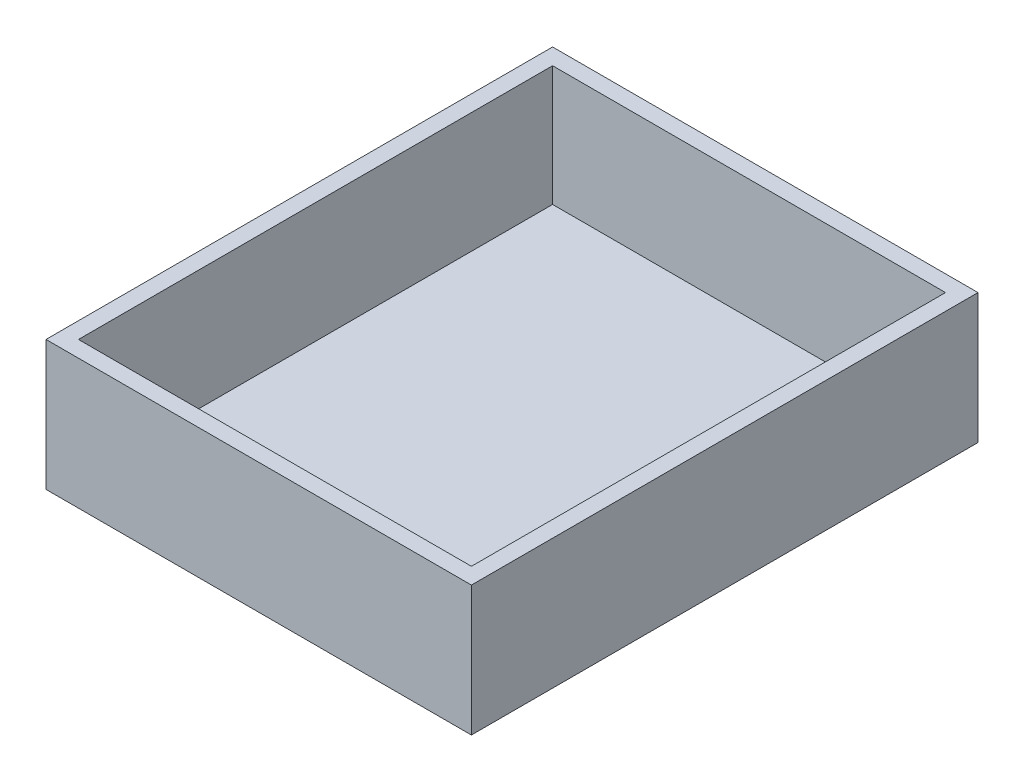
ISO-10303-21;
HEADER;
FILE_DESCRIPTION(('STEP AP214'),'2;1');
FILE_NAME('part.step','',(''),(''),'','','');
FILE_SCHEMA(('AUTOMOTIVE_DESIGN { 1 0 10303 214 1 1 1 1 }'));
ENDSEC;
DATA;
#1=APPLICATION_CONTEXT('core data for automotive mechanical design processes');
#2=APPLICATION_PROTOCOL_DEFINITION('international standard','automotive_design',2000,#1);
#3=PRODUCT_CONTEXT('',#1,'mechanical');
#4=PRODUCT('Part','Part','',(#3));
#5=PRODUCT_RELATED_PRODUCT_CATEGORY('part','',(#4));
#6=PRODUCT_DEFINITION_FORMATION('','',#4);
#7=PRODUCT_DEFINITION_CONTEXT('part definition',#1,'design');
#8=PRODUCT_DEFINITION('design','',#6,#7);
#9=PRODUCT_DEFINITION_SHAPE('','',#8);
#10=(LENGTH_UNIT() NAMED_UNIT(*) SI_UNIT(.MILLI.,.METRE.));
#11=(NAMED_UNIT(*) PLANE_ANGLE_UNIT() SI_UNIT($,.RADIAN.));
#12=(NAMED_UNIT(*) SI_UNIT($,.STERADIAN.) SOLID_ANGLE_UNIT());
#13=UNCERTAINTY_MEASURE_WITH_UNIT(LENGTH_MEASURE(1.E-05),#10,'distance_accuracy_value','');
#14=(GEOMETRIC_REPRESENTATION_CONTEXT(3) GLOBAL_UNCERTAINTY_ASSIGNED_CONTEXT((#13)) GLOBAL_UNIT_ASSIGNED_CONTEXT((#10,
#11,#12)) REPRESENTATION_CONTEXT('',''));
#15=CARTESIAN_POINT('',(0.,0.,0.));
#16=DIRECTION('',(0.,0.,1.));
#17=DIRECTION('',(1.,0.,0.));
#18=AXIS2_PLACEMENT_3D('',#15,#16,#17);
#19=CARTESIAN_POINT('',(65.5,40.,78.));
#20=DIRECTION('',(-1.,0.,0.));
#21=DIRECTION('',(0.,0.,1.));
#22=AXIS2_PLACEMENT_3D('',#19,#20,#21);
#23=PLANE('',#22);
#24=DIRECTION('',(0.,0.,-1.));
#25=VECTOR('',#24,1.);
#26=CARTESIAN_POINT('',(65.5,0.,78.));
#27=LINE('',#26,#25);
#28=CARTESIAN_POINT('',(65.5,0.,78.));
#29=VERTEX_POINT('',#28);
#30=CARTESIAN_POINT('',(65.5,0.,-78.));
#31=VERTEX_POINT('',#30);
#32=EDGE_CURVE('E142',#29,#31,#27,.T.);
#33=ORIENTED_EDGE('',*,*,#32,.T.);
#34=DIRECTION('',(0.,-1.,0.));
#35=VECTOR('',#34,1.);
#36=CARTESIAN_POINT('',(65.5,40.,-78.));
#37=LINE('',#36,#35);
#38=CARTESIAN_POINT('',(65.5,40.,-78.));
#39=VERTEX_POINT('',#38);
#40=EDGE_CURVE('E11',#39,#31,#37,.T.);
#41=ORIENTED_EDGE('',*,*,#40,.F.);
#42=DIRECTION('',(0.,0.,-1.));
#43=VECTOR('',#42,1.);
#44=CARTESIAN_POINT('',(65.5,40.,78.));
#45=LINE('',#44,#43);
#46=CARTESIAN_POINT('',(65.5,40.,78.));
#47=VERTEX_POINT('',#46);
#48=EDGE_CURVE('E146',#47,#39,#45,.T.);
#49=ORIENTED_EDGE('',*,*,#48,.F.);
#50=DIRECTION('',(0.,-1.,0.));
#51=VECTOR('',#50,1.);
#52=CARTESIAN_POINT('',(65.5,40.,78.));
#53=LINE('',#52,#51);
#54=EDGE_CURVE('E152',#47,#29,#53,.T.);
#55=ORIENTED_EDGE('',*,*,#54,.T.);
#56=EDGE_LOOP('',(#33,#41,#49,#55));
#57=FACE_BOUND('',#56,.T.);
#58=ADVANCED_FACE('F34',(#57),#23,.F.);
#59=CARTESIAN_POINT('',(65.5,40.,-78.));
#60=DIRECTION('',(0.,0.,1.));
#61=DIRECTION('',(1.,0.,0.));
#62=AXIS2_PLACEMENT_3D('',#59,#60,#61);
#63=PLANE('',#62);
#64=DIRECTION('',(-1.,0.,0.));
#65=VECTOR('',#64,1.);
#66=CARTESIAN_POINT('',(65.5,0.,-78.));
#67=LINE('',#66,#65);
#68=CARTESIAN_POINT('',(-65.5,0.,-78.));
#69=VERTEX_POINT('',#68);
#70=EDGE_CURVE('E155',#31,#69,#67,.T.);
#71=ORIENTED_EDGE('',*,*,#70,.T.);
#72=DIRECTION('',(0.,-1.,0.));
#73=VECTOR('',#72,1.);
#74=CARTESIAN_POINT('',(-65.5,40.,-78.));
#75=LINE('',#74,#73);
#76=CARTESIAN_POINT('',(-65.5,40.,-78.));
#77=VERTEX_POINT('',#76);
#78=EDGE_CURVE('E41',#77,#69,#75,.T.);
#79=ORIENTED_EDGE('',*,*,#78,.F.);
#80=DIRECTION('',(-1.,0.,0.));
#81=VECTOR('',#80,1.);
#82=CARTESIAN_POINT('',(65.5,40.,-78.));
#83=LINE('',#82,#81);
#84=EDGE_CURVE('E85',#39,#77,#83,.T.);
#85=ORIENTED_EDGE('',*,*,#84,.F.);
#86=ORIENTED_EDGE('',*,*,#40,.T.);
#87=EDGE_LOOP('',(#71,#79,#85,#86));
#88=FACE_BOUND('',#87,.T.);
#89=ADVANCED_FACE('F184',(#88),#63,.F.);
#90=CARTESIAN_POINT('',(-65.5,40.,-78.));
#91=DIRECTION('',(1.,0.,0.));
#92=DIRECTION('',(0.,0.,-1.));
#93=AXIS2_PLACEMENT_3D('',#90,#91,#92);
#94=PLANE('',#93);
#95=DIRECTION('',(0.,0.,1.));
#96=VECTOR('',#95,1.);
#97=CARTESIAN_POINT('',(-65.5,0.,-78.));
#98=LINE('',#97,#96);
#99=CARTESIAN_POINT('',(-65.5,0.,78.));
#100=VERTEX_POINT('',#99);
#101=EDGE_CURVE('E157',#69,#100,#98,.T.);
#102=ORIENTED_EDGE('',*,*,#101,.T.);
#103=DIRECTION('',(0.,-1.,0.));
#104=VECTOR('',#103,1.);
#105=CARTESIAN_POINT('',(-65.5,40.,78.));
#106=LINE('',#105,#104);
#107=CARTESIAN_POINT('',(-65.5,40.,78.));
#108=VERTEX_POINT('',#107);
#109=EDGE_CURVE('E161',#108,#100,#106,.T.);
#110=ORIENTED_EDGE('',*,*,#109,.F.);
#111=DIRECTION('',(0.,0.,1.));
#112=VECTOR('',#111,1.);
#113=CARTESIAN_POINT('',(-65.5,40.,-78.));
#114=LINE('',#113,#112);
#115=EDGE_CURVE('E149',#77,#108,#114,.T.);
#116=ORIENTED_EDGE('',*,*,#115,.F.);
#117=ORIENTED_EDGE('',*,*,#78,.T.);
#118=EDGE_LOOP('',(#102,#110,#116,#117));
#119=FACE_BOUND('',#118,.T.);
#120=ADVANCED_FACE('F166',(#119),#94,.F.);
#121=CARTESIAN_POINT('',(-65.5,40.,78.));
#122=DIRECTION('',(0.,0.,-1.));
#123=DIRECTION('',(-1.,0.,0.));
#124=AXIS2_PLACEMENT_3D('',#121,#122,#123);
#125=PLANE('',#124);
#126=DIRECTION('',(1.,0.,0.));
#127=VECTOR('',#126,1.);
#128=CARTESIAN_POINT('',(-65.5,0.,78.));
#129=LINE('',#128,#127);
#130=EDGE_CURVE('E78',#100,#29,#129,.T.);
#131=ORIENTED_EDGE('',*,*,#130,.T.);
#132=ORIENTED_EDGE('',*,*,#54,.F.);
#133=DIRECTION('',(1.,0.,0.));
#134=VECTOR('',#133,1.);
#135=CARTESIAN_POINT('',(-65.5,40.,78.));
#136=LINE('',#135,#134);
#137=EDGE_CURVE('E57',#108,#47,#136,.T.);
#138=ORIENTED_EDGE('',*,*,#137,.F.);
#139=ORIENTED_EDGE('',*,*,#109,.T.);
#140=EDGE_LOOP('',(#131,#132,#138,#139));
#141=FACE_BOUND('',#140,.T.);
#142=ADVANCED_FACE('F174',(#141),#125,.F.);
#143=CARTESIAN_POINT('',(0.,40.,0.));
#144=DIRECTION('',(0.,1.,0.));
#145=DIRECTION('',(0.,0.,1.));
#146=AXIS2_PLACEMENT_3D('',#143,#144,#145);
#147=PLANE('',#146);
#148=DIRECTION('',(1.,0.,0.));
#149=VECTOR('',#148,1.);
#150=CARTESIAN_POINT('',(-60.5,40.,73.));
#151=LINE('',#150,#149);
#152=CARTESIAN_POINT('',(-60.5,40.,73.));
#153=VERTEX_POINT('',#152);
#154=CARTESIAN_POINT('',(60.5,40.,73.));
#155=VERTEX_POINT('',#154);
#156=EDGE_CURVE('E48',#153,#155,#151,.T.);
#157=ORIENTED_EDGE('',*,*,#156,.F.);
#158=DIRECTION('',(0.,0.,1.));
#159=VECTOR('',#158,1.);
#160=CARTESIAN_POINT('',(-60.5,40.,-73.));
#161=LINE('',#160,#159);
#162=CARTESIAN_POINT('',(-60.5,40.,-73.));
#163=VERTEX_POINT('',#162);
#164=EDGE_CURVE('E127',#163,#153,#161,.T.);
#165=ORIENTED_EDGE('',*,*,#164,.F.);
#166=DIRECTION('',(-1.,0.,0.));
#167=VECTOR('',#166,1.);
#168=CARTESIAN_POINT('',(60.5,40.,-73.));
#169=LINE('',#168,#167);
#170=CARTESIAN_POINT('',(60.5,40.,-73.));
#171=VERTEX_POINT('',#170);
#172=EDGE_CURVE('E130',#171,#163,#169,.T.);
#173=ORIENTED_EDGE('',*,*,#172,.F.);
#174=DIRECTION('',(0.,0.,-1.));
#175=VECTOR('',#174,1.);
#176=CARTESIAN_POINT('',(60.5,40.,73.));
#177=LINE('',#176,#175);
#178=EDGE_CURVE('E136',#155,#171,#177,.T.);
#179=ORIENTED_EDGE('',*,*,#178,.F.);
#180=EDGE_LOOP('',(#157,#165,#173,#179));
#181=FACE_BOUND('',#180,.T.);
#182=ORIENTED_EDGE('',*,*,#48,.T.);
#183=ORIENTED_EDGE('',*,*,#84,.T.);
#184=ORIENTED_EDGE('',*,*,#115,.T.);
#185=ORIENTED_EDGE('',*,*,#137,.T.);
#186=EDGE_LOOP('',(#182,#183,#184,#185));
#187=FACE_BOUND('',#186,.T.);
#188=ADVANCED_FACE('F176',(#181,#187),#147,.T.);
#189=CARTESIAN_POINT('',(0.,0.,0.));
#190=DIRECTION('',(0.,1.,0.));
#191=DIRECTION('',(0.,0.,1.));
#192=AXIS2_PLACEMENT_3D('',#189,#190,#191);
#193=PLANE('',#192);
#194=ORIENTED_EDGE('',*,*,#32,.F.);
#195=ORIENTED_EDGE('',*,*,#130,.F.);
#196=ORIENTED_EDGE('',*,*,#101,.F.);
#197=ORIENTED_EDGE('',*,*,#70,.F.);
#198=EDGE_LOOP('',(#194,#195,#196,#197));
#199=FACE_BOUND('',#198,.T.);
#200=ADVANCED_FACE('F170',(#199),#193,.F.);
#201=CARTESIAN_POINT('',(-60.5,3.,73.));
#202=DIRECTION('',(0.,0.,1.));
#203=DIRECTION('',(1.,0.,0.));
#204=AXIS2_PLACEMENT_3D('',#201,#202,#203);
#205=PLANE('',#204);
#206=ORIENTED_EDGE('',*,*,#156,.T.);
#207=DIRECTION('',(0.,1.,0.));
#208=VECTOR('',#207,1.);
#209=CARTESIAN_POINT('',(60.5,3.,73.));
#210=LINE('',#209,#208);
#211=CARTESIAN_POINT('',(60.5,3.,73.));
#212=VERTEX_POINT('',#211);
#213=EDGE_CURVE('E105',#212,#155,#210,.T.);
#214=ORIENTED_EDGE('',*,*,#213,.F.);
#215=DIRECTION('',(1.,0.,0.));
#216=VECTOR('',#215,1.);
#217=CARTESIAN_POINT('',(-60.5,3.,73.));
#218=LINE('',#217,#216);
#219=CARTESIAN_POINT('',(-60.5,3.,73.));
#220=VERTEX_POINT('',#219);
#221=EDGE_CURVE('E109',#220,#212,#218,.T.);
#222=ORIENTED_EDGE('',*,*,#221,.F.);
#223=DIRECTION('',(0.,1.,0.));
#224=VECTOR('',#223,1.);
#225=CARTESIAN_POINT('',(-60.5,3.,73.));
#226=LINE('',#225,#224);
#227=EDGE_CURVE('E140',#220,#153,#226,.T.);
#228=ORIENTED_EDGE('',*,*,#227,.T.);
#229=EDGE_LOOP('',(#206,#214,#222,#228));
#230=FACE_BOUND('',#229,.T.);
#231=ADVANCED_FACE('F107',(#230),#205,.F.);
#232=CARTESIAN_POINT('',(-60.5,3.,-73.));
#233=DIRECTION('',(-1.,0.,0.));
#234=DIRECTION('',(0.,0.,1.));
#235=AXIS2_PLACEMENT_3D('',#232,#233,#234);
#236=PLANE('',#235);
#237=ORIENTED_EDGE('',*,*,#164,.T.);
#238=ORIENTED_EDGE('',*,*,#227,.F.);
#239=DIRECTION('',(0.,0.,1.));
#240=VECTOR('',#239,1.);
#241=CARTESIAN_POINT('',(-60.5,3.,-73.));
#242=LINE('',#241,#240);
#243=CARTESIAN_POINT('',(-60.5,3.,-73.));
#244=VERTEX_POINT('',#243);
#245=EDGE_CURVE('E115',#244,#220,#242,.T.);
#246=ORIENTED_EDGE('',*,*,#245,.F.);
#247=DIRECTION('',(0.,1.,0.));
#248=VECTOR('',#247,1.);
#249=CARTESIAN_POINT('',(-60.5,3.,-73.));
#250=LINE('',#249,#248);
#251=EDGE_CURVE('E143',#244,#163,#250,.T.);
#252=ORIENTED_EDGE('',*,*,#251,.T.);
#253=EDGE_LOOP('',(#237,#238,#246,#252));
#254=FACE_BOUND('',#253,.T.);
#255=ADVANCED_FACE('F223',(#254),#236,.F.);
#256=CARTESIAN_POINT('',(60.5,3.,-73.));
#257=DIRECTION('',(0.,0.,-1.));
#258=DIRECTION('',(-1.,0.,0.));
#259=AXIS2_PLACEMENT_3D('',#256,#257,#258);
#260=PLANE('',#259);
#261=ORIENTED_EDGE('',*,*,#172,.T.);
#262=ORIENTED_EDGE('',*,*,#251,.F.);
#263=DIRECTION('',(-1.,0.,0.));
#264=VECTOR('',#263,1.);
#265=CARTESIAN_POINT('',(60.5,3.,-73.));
#266=LINE('',#265,#264);
#267=CARTESIAN_POINT('',(60.5,3.,-73.));
#268=VERTEX_POINT('',#267);
#269=EDGE_CURVE('E123',#268,#244,#266,.T.);
#270=ORIENTED_EDGE('',*,*,#269,.F.);
#271=DIRECTION('',(0.,1.,0.));
#272=VECTOR('',#271,1.);
#273=CARTESIAN_POINT('',(60.5,3.,-73.));
#274=LINE('',#273,#272);
#275=EDGE_CURVE('E114',#268,#171,#274,.T.);
#276=ORIENTED_EDGE('',*,*,#275,.T.);
#277=EDGE_LOOP('',(#261,#262,#270,#276));
#278=FACE_BOUND('',#277,.T.);
#279=ADVANCED_FACE('F232',(#278),#260,.F.);
#280=CARTESIAN_POINT('',(60.5,3.,73.));
#281=DIRECTION('',(1.,0.,0.));
#282=DIRECTION('',(0.,0.,-1.));
#283=AXIS2_PLACEMENT_3D('',#280,#281,#282);
#284=PLANE('',#283);
#285=ORIENTED_EDGE('',*,*,#178,.T.);
#286=ORIENTED_EDGE('',*,*,#275,.F.);
#287=DIRECTION('',(0.,0.,-1.));
#288=VECTOR('',#287,1.);
#289=CARTESIAN_POINT('',(60.5,3.,73.));
#290=LINE('',#289,#288);
#291=EDGE_CURVE('E118',#212,#268,#290,.T.);
#292=ORIENTED_EDGE('',*,*,#291,.F.);
#293=ORIENTED_EDGE('',*,*,#213,.T.);
#294=EDGE_LOOP('',(#285,#286,#292,#293));
#295=FACE_BOUND('',#294,.T.);
#296=ADVANCED_FACE('F119',(#295),#284,.F.);
#297=CARTESIAN_POINT('',(0.,3.,0.));
#298=DIRECTION('',(0.,1.,0.));
#299=DIRECTION('',(0.,0.,1.));
#300=AXIS2_PLACEMENT_3D('',#297,#298,#299);
#301=PLANE('',#300);
#302=ORIENTED_EDGE('',*,*,#221,.T.);
#303=ORIENTED_EDGE('',*,*,#291,.T.);
#304=ORIENTED_EDGE('',*,*,#269,.T.);
#305=ORIENTED_EDGE('',*,*,#245,.T.);
#306=EDGE_LOOP('',(#302,#303,#304,#305));
#307=FACE_BOUND('',#306,.T.);
#308=ADVANCED_FACE('F125',(#307),#301,.T.);
#309=CLOSED_SHELL('',(#58,#89,#120,#142,#188,#200,#231,#255,#279,#296,#308));
#310=MANIFOLD_SOLID_BREP('B2',#309);
#311=ADVANCED_BREP_SHAPE_REPRESENTATION('',(#18,#310),#14);
#312=SHAPE_DEFINITION_REPRESENTATION(#9,#311);
ENDSEC;
END-ISO-10303-21;
